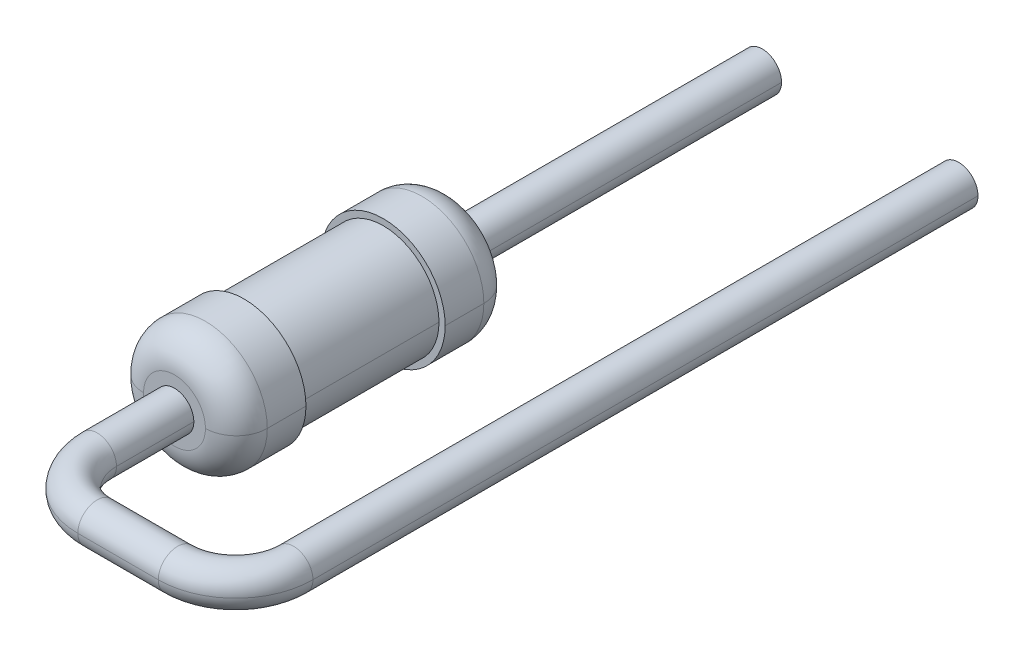
ISO-10303-21;
HEADER;
FILE_DESCRIPTION(('STEP AP214'),'2;1');
FILE_NAME('part.step','',(''),(''),'','','');
FILE_SCHEMA(('AUTOMOTIVE_DESIGN { 1 0 10303 214 1 1 1 1 }'));
ENDSEC;
DATA;
#1=APPLICATION_CONTEXT('core data for automotive mechanical design processes');
#2=APPLICATION_PROTOCOL_DEFINITION('international standard','automotive_design',2000,#1);
#3=PRODUCT_CONTEXT('',#1,'mechanical');
#4=PRODUCT('Part','Part','',(#3));
#5=PRODUCT_RELATED_PRODUCT_CATEGORY('part','',(#4));
#6=PRODUCT_DEFINITION_FORMATION('','',#4);
#7=PRODUCT_DEFINITION_CONTEXT('part definition',#1,'design');
#8=PRODUCT_DEFINITION('design','',#6,#7);
#9=PRODUCT_DEFINITION_SHAPE('','',#8);
#10=(LENGTH_UNIT() NAMED_UNIT(*) SI_UNIT(.MILLI.,.METRE.));
#11=(NAMED_UNIT(*) PLANE_ANGLE_UNIT() SI_UNIT($,.RADIAN.));
#12=(NAMED_UNIT(*) SI_UNIT($,.STERADIAN.) SOLID_ANGLE_UNIT());
#13=UNCERTAINTY_MEASURE_WITH_UNIT(LENGTH_MEASURE(1.E-05),#10,'distance_accuracy_value','');
#14=(GEOMETRIC_REPRESENTATION_CONTEXT(3) GLOBAL_UNCERTAINTY_ASSIGNED_CONTEXT((#13)) GLOBAL_UNIT_ASSIGNED_CONTEXT((#10,
#11,#12)) REPRESENTATION_CONTEXT('',''));
#15=CARTESIAN_POINT('',(0.,0.,0.));
#16=DIRECTION('',(0.,0.,1.));
#17=DIRECTION('',(1.,0.,0.));
#18=AXIS2_PLACEMENT_3D('',#15,#16,#17);
#19=CARTESIAN_POINT('',(0.,0.,1.));
#20=DIRECTION('',(0.,0.,-1.));
#21=DIRECTION('',(1.,0.,0.));
#22=AXIS2_PLACEMENT_3D('',#19,#20,#21);
#23=CYLINDRICAL_SURFACE('',#22,0.8);
#24=DIRECTION('',(0.,0.,-1.));
#25=VECTOR('',#24,1.);
#26=CARTESIAN_POINT('',(-0.8,0.,1.));
#27=LINE('',#26,#25);
#28=CARTESIAN_POINT('',(-0.8,0.,1.9));
#29=VERTEX_POINT('',#28);
#30=CARTESIAN_POINT('',(-0.8,0.,1.4));
#31=VERTEX_POINT('',#30);
#32=EDGE_CURVE('E224',#29,#31,#27,.T.);
#33=ORIENTED_EDGE('',*,*,#32,.F.);
#34=CARTESIAN_POINT('',(0.,0.,1.9));
#35=DIRECTION('',(0.,0.,1.));
#36=DIRECTION('',(1.,0.,0.));
#37=AXIS2_PLACEMENT_3D('',#34,#35,#36);
#38=CIRCLE('',#37,0.8);
#39=CARTESIAN_POINT('',(0.8,0.,1.9));
#40=VERTEX_POINT('',#39);
#41=EDGE_CURVE('E26',#40,#29,#38,.T.);
#42=ORIENTED_EDGE('',*,*,#41,.F.);
#43=DIRECTION('',(0.,0.,-1.));
#44=VECTOR('',#43,1.);
#45=CARTESIAN_POINT('',(0.8,0.,1.));
#46=LINE('',#45,#44);
#47=CARTESIAN_POINT('',(0.8,0.,1.4));
#48=VERTEX_POINT('',#47);
#49=EDGE_CURVE('E248',#40,#48,#46,.T.);
#50=ORIENTED_EDGE('',*,*,#49,.T.);
#51=CARTESIAN_POINT('',(0.,0.,1.4));
#52=DIRECTION('',(0.,0.,1.));
#53=DIRECTION('',(1.,0.,0.));
#54=AXIS2_PLACEMENT_3D('',#51,#52,#53);
#55=CIRCLE('',#54,0.8);
#56=EDGE_CURVE('E11',#48,#31,#55,.T.);
#57=ORIENTED_EDGE('',*,*,#56,.T.);
#58=EDGE_LOOP('',(#33,#42,#50,#57));
#59=FACE_BOUND('',#58,.T.);
#60=ADVANCED_FACE('F16',(#59),#23,.T.);
#61=CARTESIAN_POINT('',(0.,0.,1.4));
#62=DIRECTION('',(0.,0.,-1.));
#63=DIRECTION('',(1.,0.,0.));
#64=AXIS2_PLACEMENT_3D('',#61,#62,#63);
#65=DEGENERATE_TOROIDAL_SURFACE('',#64,0.4,0.4,.T.);
#66=CARTESIAN_POINT('',(-0.4,0.,1.4));
#67=DIRECTION('',(0.,-1.,0.));
#68=DIRECTION('',(1.,0.,0.));
#69=AXIS2_PLACEMENT_3D('',#66,#67,#68);
#70=CIRCLE('',#69,0.4);
#71=CARTESIAN_POINT('',(-0.4,0.,1.));
#72=VERTEX_POINT('',#71);
#73=EDGE_CURVE('E297',#31,#72,#70,.T.);
#74=ORIENTED_EDGE('',*,*,#73,.F.);
#75=ORIENTED_EDGE('',*,*,#56,.F.);
#76=CARTESIAN_POINT('',(0.4,0.,1.4));
#77=DIRECTION('',(0.,1.,0.));
#78=DIRECTION('',(0.,0.,1.));
#79=AXIS2_PLACEMENT_3D('',#76,#77,#78);
#80=CIRCLE('',#79,0.4);
#81=CARTESIAN_POINT('',(0.4,0.,1.));
#82=VERTEX_POINT('',#81);
#83=EDGE_CURVE('E20',#48,#82,#80,.T.);
#84=ORIENTED_EDGE('',*,*,#83,.T.);
#85=CARTESIAN_POINT('',(0.,0.,1.));
#86=DIRECTION('',(0.,0.,1.));
#87=DIRECTION('',(1.,0.,0.));
#88=AXIS2_PLACEMENT_3D('',#85,#86,#87);
#89=CIRCLE('',#88,0.4);
#90=EDGE_CURVE('E143',#82,#72,#89,.T.);
#91=ORIENTED_EDGE('',*,*,#90,.T.);
#92=EDGE_LOOP('',(#74,#75,#84,#91));
#93=FACE_BOUND('',#92,.T.);
#94=ADVANCED_FACE('F387',(#93),#65,.T.);
#95=CARTESIAN_POINT('',(0.8,0.,1.9));
#96=DIRECTION('',(0.,0.,-1.));
#97=DIRECTION('',(0.,-1.,0.));
#98=AXIS2_PLACEMENT_3D('',#95,#96,#97);
#99=PLANE('',#98);
#100=CARTESIAN_POINT('',(0.,0.,1.9));
#101=DIRECTION('',(0.,0.,-1.));
#102=DIRECTION('',(1.,0.,0.));
#103=AXIS2_PLACEMENT_3D('',#100,#101,#102);
#104=CIRCLE('',#103,0.72);
#105=CARTESIAN_POINT('',(0.72,0.,1.9));
#106=VERTEX_POINT('',#105);
#107=CARTESIAN_POINT('',(-0.72,0.,1.9));
#108=VERTEX_POINT('',#107);
#109=EDGE_CURVE('E240',#106,#108,#104,.T.);
#110=ORIENTED_EDGE('',*,*,#109,.T.);
#111=CARTESIAN_POINT('',(0.,0.,1.9));
#112=DIRECTION('',(0.,0.,-1.));
#113=DIRECTION('',(1.,0.,0.));
#114=AXIS2_PLACEMENT_3D('',#111,#112,#113);
#115=CIRCLE('',#114,0.72);
#116=EDGE_CURVE('E365',#108,#106,#115,.T.);
#117=ORIENTED_EDGE('',*,*,#116,.T.);
#118=EDGE_LOOP('',(#110,#117));
#119=FACE_BOUND('',#118,.T.);
#120=ORIENTED_EDGE('',*,*,#41,.T.);
#121=CARTESIAN_POINT('',(0.,0.,1.9));
#122=DIRECTION('',(0.,0.,1.));
#123=DIRECTION('',(1.,0.,0.));
#124=AXIS2_PLACEMENT_3D('',#121,#122,#123);
#125=CIRCLE('',#124,0.8);
#126=EDGE_CURVE('E207',#29,#40,#125,.T.);
#127=ORIENTED_EDGE('',*,*,#126,.T.);
#128=EDGE_LOOP('',(#120,#127));
#129=FACE_BOUND('',#128,.T.);
#130=ADVANCED_FACE('F383',(#119,#129),#99,.F.);
#131=CARTESIAN_POINT('',(0.8,0.,1.));
#132=DIRECTION('',(0.,0.,-1.));
#133=DIRECTION('',(0.,-1.,0.));
#134=AXIS2_PLACEMENT_3D('',#131,#132,#133);
#135=PLANE('',#134);
#136=CARTESIAN_POINT('',(0.,0.,1.));
#137=DIRECTION('',(0.,0.,1.));
#138=DIRECTION('',(1.,0.,0.));
#139=AXIS2_PLACEMENT_3D('',#136,#137,#138);
#140=CIRCLE('',#139,0.25);
#141=CARTESIAN_POINT('',(0.25,0.,1.));
#142=VERTEX_POINT('',#141);
#143=CARTESIAN_POINT('',(-0.25,0.,1.));
#144=VERTEX_POINT('',#143);
#145=EDGE_CURVE('E249',#142,#144,#140,.T.);
#146=ORIENTED_EDGE('',*,*,#145,.T.);
#147=CARTESIAN_POINT('',(0.,0.,1.));
#148=DIRECTION('',(0.,0.,1.));
#149=DIRECTION('',(1.,0.,0.));
#150=AXIS2_PLACEMENT_3D('',#147,#148,#149);
#151=CIRCLE('',#150,0.25);
#152=EDGE_CURVE('E334',#144,#142,#151,.T.);
#153=ORIENTED_EDGE('',*,*,#152,.T.);
#154=EDGE_LOOP('',(#146,#153));
#155=FACE_BOUND('',#154,.T.);
#156=ORIENTED_EDGE('',*,*,#90,.F.);
#157=CARTESIAN_POINT('',(0.,0.,1.));
#158=DIRECTION('',(0.,0.,1.));
#159=DIRECTION('',(1.,0.,0.));
#160=AXIS2_PLACEMENT_3D('',#157,#158,#159);
#161=CIRCLE('',#160,0.4);
#162=EDGE_CURVE('E293',#72,#82,#161,.T.);
#163=ORIENTED_EDGE('',*,*,#162,.F.);
#164=EDGE_LOOP('',(#156,#163));
#165=FACE_BOUND('',#164,.T.);
#166=ADVANCED_FACE('F386',(#155,#165),#135,.T.);
#167=CARTESIAN_POINT('',(0.,0.,1.));
#168=DIRECTION('',(0.,0.,-1.));
#169=DIRECTION('',(1.,0.,0.));
#170=AXIS2_PLACEMENT_3D('',#167,#168,#169);
#171=CYLINDRICAL_SURFACE('',#170,0.72);
#172=DIRECTION('',(0.,0.,-1.));
#173=VECTOR('',#172,1.);
#174=CARTESIAN_POINT('',(-0.72,0.,1.));
#175=LINE('',#174,#173);
#176=CARTESIAN_POINT('',(-0.72,0.,3.7));
#177=VERTEX_POINT('',#176);
#178=EDGE_CURVE('E234',#177,#108,#175,.T.);
#179=ORIENTED_EDGE('',*,*,#178,.F.);
#180=CARTESIAN_POINT('',(0.,0.,3.7));
#181=DIRECTION('',(0.,0.,-1.));
#182=DIRECTION('',(1.,0.,0.));
#183=AXIS2_PLACEMENT_3D('',#180,#181,#182);
#184=CIRCLE('',#183,0.72);
#185=CARTESIAN_POINT('',(0.72,0.,3.7));
#186=VERTEX_POINT('',#185);
#187=EDGE_CURVE('E325',#177,#186,#184,.T.);
#188=ORIENTED_EDGE('',*,*,#187,.T.);
#189=DIRECTION('',(0.,0.,-1.));
#190=VECTOR('',#189,1.);
#191=CARTESIAN_POINT('',(0.72,0.,1.));
#192=LINE('',#191,#190);
#193=EDGE_CURVE('E244',#186,#106,#192,.T.);
#194=ORIENTED_EDGE('',*,*,#193,.T.);
#195=ORIENTED_EDGE('',*,*,#116,.F.);
#196=EDGE_LOOP('',(#179,#188,#194,#195));
#197=FACE_BOUND('',#196,.T.);
#198=ADVANCED_FACE('F378',(#197),#171,.T.);
#199=CARTESIAN_POINT('',(0.,0.,-3.));
#200=DIRECTION('',(0.,0.,1.));
#201=DIRECTION('',(1.,0.,0.));
#202=AXIS2_PLACEMENT_3D('',#199,#200,#201);
#203=CYLINDRICAL_SURFACE('',#202,0.25);
#204=DIRECTION('',(0.,0.,1.));
#205=VECTOR('',#204,1.);
#206=CARTESIAN_POINT('',(-0.25,0.,-3.));
#207=LINE('',#206,#205);
#208=CARTESIAN_POINT('',(-0.25,0.,-3.));
#209=VERTEX_POINT('',#208);
#210=EDGE_CURVE('E254',#209,#144,#207,.T.);
#211=ORIENTED_EDGE('',*,*,#210,.F.);
#212=CARTESIAN_POINT('',(0.,0.,-3.));
#213=DIRECTION('',(0.,0.,1.));
#214=DIRECTION('',(1.,0.,0.));
#215=AXIS2_PLACEMENT_3D('',#212,#213,#214);
#216=CIRCLE('',#215,0.25);
#217=CARTESIAN_POINT('',(0.25,0.,-3.));
#218=VERTEX_POINT('',#217);
#219=EDGE_CURVE('E320',#209,#218,#216,.T.);
#220=ORIENTED_EDGE('',*,*,#219,.T.);
#221=DIRECTION('',(0.,0.,1.));
#222=VECTOR('',#221,1.);
#223=CARTESIAN_POINT('',(0.25,0.,-3.));
#224=LINE('',#223,#222);
#225=EDGE_CURVE('E253',#218,#142,#224,.T.);
#226=ORIENTED_EDGE('',*,*,#225,.T.);
#227=ORIENTED_EDGE('',*,*,#152,.F.);
#228=EDGE_LOOP('',(#211,#220,#226,#227));
#229=FACE_BOUND('',#228,.T.);
#230=ADVANCED_FACE('F616',(#229),#203,.T.);
#231=CARTESIAN_POINT('',(0.8,0.,3.7));
#232=DIRECTION('',(0.,0.,-1.));
#233=DIRECTION('',(0.,-1.,0.));
#234=AXIS2_PLACEMENT_3D('',#231,#232,#233);
#235=PLANE('',#234);
#236=CARTESIAN_POINT('',(0.,0.,3.7));
#237=DIRECTION('',(0.,0.,-1.));
#238=DIRECTION('',(1.,0.,0.));
#239=AXIS2_PLACEMENT_3D('',#236,#237,#238);
#240=CIRCLE('',#239,0.72);
#241=EDGE_CURVE('E230',#186,#177,#240,.T.);
#242=ORIENTED_EDGE('',*,*,#241,.F.);
#243=ORIENTED_EDGE('',*,*,#187,.F.);
#244=EDGE_LOOP('',(#242,#243));
#245=FACE_BOUND('',#244,.T.);
#246=CARTESIAN_POINT('',(0.,0.,3.7));
#247=DIRECTION('',(0.,0.,1.));
#248=DIRECTION('',(1.,0.,0.));
#249=AXIS2_PLACEMENT_3D('',#246,#247,#248);
#250=CIRCLE('',#249,0.8);
#251=CARTESIAN_POINT('',(0.8,0.,3.7));
#252=VERTEX_POINT('',#251);
#253=CARTESIAN_POINT('',(-0.8,0.,3.7));
#254=VERTEX_POINT('',#253);
#255=EDGE_CURVE('E311',#252,#254,#250,.T.);
#256=ORIENTED_EDGE('',*,*,#255,.F.);
#257=CARTESIAN_POINT('',(0.,0.,3.7));
#258=DIRECTION('',(0.,0.,1.));
#259=DIRECTION('',(1.,0.,0.));
#260=AXIS2_PLACEMENT_3D('',#257,#258,#259);
#261=CIRCLE('',#260,0.8);
#262=EDGE_CURVE('E346',#254,#252,#261,.T.);
#263=ORIENTED_EDGE('',*,*,#262,.F.);
#264=EDGE_LOOP('',(#256,#263));
#265=FACE_BOUND('',#264,.T.);
#266=ADVANCED_FACE('F575',(#245,#265),#235,.T.);
#267=CARTESIAN_POINT('',(0.25,0.,-3.));
#268=DIRECTION('',(0.,0.,-1.));
#269=DIRECTION('',(0.,-1.,0.));
#270=AXIS2_PLACEMENT_3D('',#267,#268,#269);
#271=PLANE('',#270);
#272=CARTESIAN_POINT('',(0.,0.,-3.));
#273=DIRECTION('',(0.,0.,1.));
#274=DIRECTION('',(1.,0.,0.));
#275=AXIS2_PLACEMENT_3D('',#272,#273,#274);
#276=CIRCLE('',#275,0.25);
#277=EDGE_CURVE('E279',#218,#209,#276,.T.);
#278=ORIENTED_EDGE('',*,*,#277,.F.);
#279=ORIENTED_EDGE('',*,*,#219,.F.);
#280=EDGE_LOOP('',(#278,#279));
#281=FACE_BOUND('',#280,.T.);
#282=ADVANCED_FACE('F535',(#281),#271,.T.);
#283=CARTESIAN_POINT('',(0.,0.,3.7));
#284=DIRECTION('',(0.,0.,-1.));
#285=DIRECTION('',(1.,0.,0.));
#286=AXIS2_PLACEMENT_3D('',#283,#284,#285);
#287=CYLINDRICAL_SURFACE('',#286,0.8);
#288=DIRECTION('',(0.,0.,-1.));
#289=VECTOR('',#288,1.);
#290=CARTESIAN_POINT('',(-0.8,0.,3.7));
#291=LINE('',#290,#289);
#292=CARTESIAN_POINT('',(-0.8,0.,4.2));
#293=VERTEX_POINT('',#292);
#294=EDGE_CURVE('E342',#293,#254,#291,.T.);
#295=ORIENTED_EDGE('',*,*,#294,.F.);
#296=CARTESIAN_POINT('',(0.,0.,4.2));
#297=DIRECTION('',(0.,0.,1.));
#298=DIRECTION('',(1.,0.,0.));
#299=AXIS2_PLACEMENT_3D('',#296,#297,#298);
#300=CIRCLE('',#299,0.8);
#301=CARTESIAN_POINT('',(0.8,0.,4.2));
#302=VERTEX_POINT('',#301);
#303=EDGE_CURVE('E275',#302,#293,#300,.T.);
#304=ORIENTED_EDGE('',*,*,#303,.F.);
#305=DIRECTION('',(0.,0.,-1.));
#306=VECTOR('',#305,1.);
#307=CARTESIAN_POINT('',(0.8,0.,3.7));
#308=LINE('',#307,#306);
#309=EDGE_CURVE('E222',#302,#252,#308,.T.);
#310=ORIENTED_EDGE('',*,*,#309,.T.);
#311=ORIENTED_EDGE('',*,*,#255,.T.);
#312=EDGE_LOOP('',(#295,#304,#310,#311));
#313=FACE_BOUND('',#312,.T.);
#314=ADVANCED_FACE('F434',(#313),#287,.T.);
#315=CARTESIAN_POINT('',(0.,0.,4.2));
#316=DIRECTION('',(0.,0.,1.));
#317=DIRECTION('',(1.,0.,0.));
#318=AXIS2_PLACEMENT_3D('',#315,#316,#317);
#319=DEGENERATE_TOROIDAL_SURFACE('',#318,0.4,0.4,.T.);
#320=CARTESIAN_POINT('',(-0.4,0.,4.2));
#321=DIRECTION('',(0.,1.,0.));
#322=DIRECTION('',(-1.,0.,0.));
#323=AXIS2_PLACEMENT_3D('',#320,#321,#322);
#324=CIRCLE('',#323,0.4);
#325=CARTESIAN_POINT('',(-0.4,0.,4.6));
#326=VERTEX_POINT('',#325);
#327=EDGE_CURVE('E270',#293,#326,#324,.T.);
#328=ORIENTED_EDGE('',*,*,#327,.F.);
#329=CARTESIAN_POINT('',(0.,0.,4.2));
#330=DIRECTION('',(0.,0.,1.));
#331=DIRECTION('',(1.,0.,0.));
#332=AXIS2_PLACEMENT_3D('',#329,#330,#331);
#333=CIRCLE('',#332,0.8);
#334=EDGE_CURVE('E269',#293,#302,#333,.T.);
#335=ORIENTED_EDGE('',*,*,#334,.T.);
#336=CARTESIAN_POINT('',(0.4,0.,4.2));
#337=DIRECTION('',(0.,-1.,0.));
#338=DIRECTION('',(0.,0.,-1.));
#339=AXIS2_PLACEMENT_3D('',#336,#337,#338);
#340=CIRCLE('',#339,0.4);
#341=CARTESIAN_POINT('',(0.4,0.,4.6));
#342=VERTEX_POINT('',#341);
#343=EDGE_CURVE('E260',#302,#342,#340,.T.);
#344=ORIENTED_EDGE('',*,*,#343,.T.);
#345=CARTESIAN_POINT('',(0.,0.,4.6));
#346=DIRECTION('',(0.,0.,1.));
#347=DIRECTION('',(1.,0.,0.));
#348=AXIS2_PLACEMENT_3D('',#345,#346,#347);
#349=CIRCLE('',#348,0.4);
#350=EDGE_CURVE('E303',#326,#342,#349,.T.);
#351=ORIENTED_EDGE('',*,*,#350,.F.);
#352=EDGE_LOOP('',(#328,#335,#344,#351));
#353=FACE_BOUND('',#352,.T.);
#354=ADVANCED_FACE('F429',(#353),#319,.T.);
#355=CARTESIAN_POINT('',(0.8,0.,4.6));
#356=DIRECTION('',(0.,0.,-1.));
#357=DIRECTION('',(0.,-1.,0.));
#358=AXIS2_PLACEMENT_3D('',#355,#356,#357);
#359=PLANE('',#358);
#360=CARTESIAN_POINT('',(0.,0.,4.6));
#361=DIRECTION('',(0.,0.,1.));
#362=DIRECTION('',(1.,0.,0.));
#363=AXIS2_PLACEMENT_3D('',#360,#361,#362);
#364=CIRCLE('',#363,0.25);
#365=CARTESIAN_POINT('',(0.25,0.,4.6));
#366=VERTEX_POINT('',#365);
#367=CARTESIAN_POINT('',(-0.25,0.,4.6));
#368=VERTEX_POINT('',#367);
#369=EDGE_CURVE('E255',#366,#368,#364,.T.);
#370=ORIENTED_EDGE('',*,*,#369,.F.);
#371=CARTESIAN_POINT('',(0.,0.,4.6));
#372=DIRECTION('',(0.,0.,1.));
#373=DIRECTION('',(1.,0.,0.));
#374=AXIS2_PLACEMENT_3D('',#371,#372,#373);
#375=CIRCLE('',#374,0.25);
#376=EDGE_CURVE('E300',#368,#366,#375,.T.);
#377=ORIENTED_EDGE('',*,*,#376,.F.);
#378=EDGE_LOOP('',(#370,#377));
#379=FACE_BOUND('',#378,.T.);
#380=CARTESIAN_POINT('',(0.,0.,4.6));
#381=DIRECTION('',(0.,0.,1.));
#382=DIRECTION('',(1.,0.,0.));
#383=AXIS2_PLACEMENT_3D('',#380,#381,#382);
#384=CIRCLE('',#383,0.4);
#385=EDGE_CURVE('E274',#342,#326,#384,.T.);
#386=ORIENTED_EDGE('',*,*,#385,.T.);
#387=ORIENTED_EDGE('',*,*,#350,.T.);
#388=EDGE_LOOP('',(#386,#387));
#389=FACE_BOUND('',#388,.T.);
#390=ADVANCED_FACE('F433',(#379,#389),#359,.F.);
#391=CARTESIAN_POINT('',(0.,0.,-3.));
#392=DIRECTION('',(0.,0.,1.));
#393=DIRECTION('',(1.,0.,0.));
#394=AXIS2_PLACEMENT_3D('',#391,#392,#393);
#395=CYLINDRICAL_SURFACE('',#394,0.25);
#396=DIRECTION('',(0.,0.,1.));
#397=VECTOR('',#396,1.);
#398=CARTESIAN_POINT('',(-0.25,0.,-3.));
#399=LINE('',#398,#397);
#400=CARTESIAN_POINT('',(-0.25,0.,5.6));
#401=VERTEX_POINT('',#400);
#402=EDGE_CURVE('E259',#368,#401,#399,.T.);
#403=ORIENTED_EDGE('',*,*,#402,.F.);
#404=ORIENTED_EDGE('',*,*,#376,.T.);
#405=DIRECTION('',(0.,0.,1.));
#406=VECTOR('',#405,1.);
#407=CARTESIAN_POINT('',(0.25,0.,-3.));
#408=LINE('',#407,#406);
#409=CARTESIAN_POINT('',(0.25,0.,5.6));
#410=VERTEX_POINT('',#409);
#411=EDGE_CURVE('E261',#366,#410,#408,.T.);
#412=ORIENTED_EDGE('',*,*,#411,.T.);
#413=CARTESIAN_POINT('',(0.,0.,5.6));
#414=DIRECTION('',(0.,0.,1.));
#415=DIRECTION('',(1.,0.,0.));
#416=AXIS2_PLACEMENT_3D('',#413,#414,#415);
#417=CIRCLE('',#416,0.25);
#418=EDGE_CURVE('E298',#401,#410,#417,.T.);
#419=ORIENTED_EDGE('',*,*,#418,.F.);
#420=EDGE_LOOP('',(#403,#404,#412,#419));
#421=FACE_BOUND('',#420,.T.);
#422=ADVANCED_FACE('F413',(#421),#395,.T.);
#423=CARTESIAN_POINT('',(0.75,0.,5.6));
#424=DIRECTION('',(0.,1.,0.));
#425=DIRECTION('',(-1.,0.,0.));
#426=AXIS2_PLACEMENT_3D('',#423,#424,#425);
#427=TOROIDAL_SURFACE('',#426,0.75,0.25);
#428=CARTESIAN_POINT('',(0.75,0.,5.6));
#429=DIRECTION('',(0.,1.,0.));
#430=DIRECTION('',(0.,0.,1.));
#431=AXIS2_PLACEMENT_3D('',#428,#429,#430);
#432=CIRCLE('',#431,1.);
#433=CARTESIAN_POINT('',(0.75,0.,6.6));
#434=VERTEX_POINT('',#433);
#435=EDGE_CURVE('E283',#401,#434,#432,.T.);
#436=ORIENTED_EDGE('',*,*,#435,.F.);
#437=ORIENTED_EDGE('',*,*,#418,.T.);
#438=CARTESIAN_POINT('',(0.75,0.,5.6));
#439=DIRECTION('',(0.,1.,0.));
#440=DIRECTION('',(0.,0.,1.));
#441=AXIS2_PLACEMENT_3D('',#438,#439,#440);
#442=CIRCLE('',#441,0.5);
#443=CARTESIAN_POINT('',(0.75,0.,6.1));
#444=VERTEX_POINT('',#443);
#445=EDGE_CURVE('E341',#410,#444,#442,.T.);
#446=ORIENTED_EDGE('',*,*,#445,.T.);
#447=CARTESIAN_POINT('',(0.75,0.,6.35));
#448=DIRECTION('',(-1.,0.,0.));
#449=DIRECTION('',(0.,0.,1.));
#450=AXIS2_PLACEMENT_3D('',#447,#448,#449);
#451=CIRCLE('',#450,0.25);
#452=EDGE_CURVE('E301',#444,#434,#451,.T.);
#453=ORIENTED_EDGE('',*,*,#452,.T.);
#454=EDGE_LOOP('',(#436,#437,#446,#453));
#455=FACE_BOUND('',#454,.T.);
#456=ADVANCED_FACE('F407',(#455),#427,.T.);
#457=CARTESIAN_POINT('',(0.75,0.,6.35));
#458=DIRECTION('',(1.,0.,0.));
#459=DIRECTION('',(0.,0.,-1.));
#460=AXIS2_PLACEMENT_3D('',#457,#458,#459);
#461=CYLINDRICAL_SURFACE('',#460,0.25);
#462=DIRECTION('',(1.,0.,0.));
#463=VECTOR('',#462,1.);
#464=CARTESIAN_POINT('',(0.75,0.,6.6));
#465=LINE('',#464,#463);
#466=CARTESIAN_POINT('',(1.79,0.,6.6));
#467=VERTEX_POINT('',#466);
#468=EDGE_CURVE('E265',#434,#467,#465,.T.);
#469=ORIENTED_EDGE('',*,*,#468,.F.);
#470=ORIENTED_EDGE('',*,*,#452,.F.);
#471=DIRECTION('',(1.,0.,0.));
#472=VECTOR('',#471,1.);
#473=CARTESIAN_POINT('',(0.75,0.,6.1));
#474=LINE('',#473,#472);
#475=CARTESIAN_POINT('',(1.79,0.,6.1));
#476=VERTEX_POINT('',#475);
#477=EDGE_CURVE('E292',#444,#476,#474,.T.);
#478=ORIENTED_EDGE('',*,*,#477,.T.);
#479=CARTESIAN_POINT('',(1.79,0.,6.35));
#480=DIRECTION('',(1.,0.,0.));
#481=DIRECTION('',(0.,0.,-1.));
#482=AXIS2_PLACEMENT_3D('',#479,#480,#481);
#483=CIRCLE('',#482,0.25);
#484=EDGE_CURVE('E189',#467,#476,#483,.T.);
#485=ORIENTED_EDGE('',*,*,#484,.F.);
#486=EDGE_LOOP('',(#469,#470,#478,#485));
#487=FACE_BOUND('',#486,.T.);
#488=ADVANCED_FACE('F412',(#487),#461,.T.);
#489=CARTESIAN_POINT('',(1.79,0.,5.6));
#490=DIRECTION('',(0.,1.,0.));
#491=DIRECTION('',(0.,0.,1.));
#492=AXIS2_PLACEMENT_3D('',#489,#490,#491);
#493=TOROIDAL_SURFACE('',#492,0.75,0.25);
#494=CARTESIAN_POINT('',(1.79,0.,5.6));
#495=DIRECTION('',(0.,1.,0.));
#496=DIRECTION('',(0.,0.,1.));
#497=AXIS2_PLACEMENT_3D('',#494,#495,#496);
#498=CIRCLE('',#497,1.);
#499=CARTESIAN_POINT('',(2.79,0.,5.6));
#500=VERTEX_POINT('',#499);
#501=EDGE_CURVE('E210',#467,#500,#498,.T.);
#502=ORIENTED_EDGE('',*,*,#501,.F.);
#503=ORIENTED_EDGE('',*,*,#484,.T.);
#504=CARTESIAN_POINT('',(1.79,0.,5.6));
#505=DIRECTION('',(0.,1.,0.));
#506=DIRECTION('',(0.,0.,1.));
#507=AXIS2_PLACEMENT_3D('',#504,#505,#506);
#508=CIRCLE('',#507,0.5);
#509=CARTESIAN_POINT('',(2.29,0.,5.6));
#510=VERTEX_POINT('',#509);
#511=EDGE_CURVE('E200',#476,#510,#508,.T.);
#512=ORIENTED_EDGE('',*,*,#511,.T.);
#513=CARTESIAN_POINT('',(2.54,0.,5.6));
#514=DIRECTION('',(0.,0.,1.));
#515=DIRECTION('',(1.,0.,0.));
#516=AXIS2_PLACEMENT_3D('',#513,#514,#515);
#517=CIRCLE('',#516,0.25);
#518=EDGE_CURVE('E177',#510,#500,#517,.T.);
#519=ORIENTED_EDGE('',*,*,#518,.T.);
#520=EDGE_LOOP('',(#502,#503,#512,#519));
#521=FACE_BOUND('',#520,.T.);
#522=ADVANCED_FACE('F201',(#521),#493,.T.);
#523=CARTESIAN_POINT('',(2.54,0.,5.6));
#524=DIRECTION('',(0.,0.,-1.));
#525=DIRECTION('',(-1.,0.,0.));
#526=AXIS2_PLACEMENT_3D('',#523,#524,#525);
#527=CYLINDRICAL_SURFACE('',#526,0.25);
#528=DIRECTION('',(0.,0.,-1.));
#529=VECTOR('',#528,1.);
#530=CARTESIAN_POINT('',(2.79,0.,5.6));
#531=LINE('',#530,#529);
#532=CARTESIAN_POINT('',(2.79,0.,-3.));
#533=VERTEX_POINT('',#532);
#534=EDGE_CURVE('E183',#500,#533,#531,.T.);
#535=ORIENTED_EDGE('',*,*,#534,.F.);
#536=ORIENTED_EDGE('',*,*,#518,.F.);
#537=DIRECTION('',(0.,0.,-1.));
#538=VECTOR('',#537,1.);
#539=CARTESIAN_POINT('',(2.29,0.,5.6));
#540=LINE('',#539,#538);
#541=CARTESIAN_POINT('',(2.29,0.,-3.));
#542=VERTEX_POINT('',#541);
#543=EDGE_CURVE('E180',#510,#542,#540,.T.);
#544=ORIENTED_EDGE('',*,*,#543,.T.);
#545=CARTESIAN_POINT('',(2.54,0.,-3.));
#546=DIRECTION('',(0.,0.,-1.));
#547=DIRECTION('',(-1.,0.,0.));
#548=AXIS2_PLACEMENT_3D('',#545,#546,#547);
#549=CIRCLE('',#548,0.25);
#550=EDGE_CURVE('E39',#533,#542,#549,.T.);
#551=ORIENTED_EDGE('',*,*,#550,.F.);
#552=EDGE_LOOP('',(#535,#536,#544,#551));
#553=FACE_BOUND('',#552,.T.);
#554=ADVANCED_FACE('F179',(#553),#527,.T.);
#555=CARTESIAN_POINT('',(2.29,0.,-3.));
#556=DIRECTION('',(0.,0.,1.));
#557=DIRECTION('',(1.,0.,0.));
#558=AXIS2_PLACEMENT_3D('',#555,#556,#557);
#559=PLANE('',#558);
#560=CARTESIAN_POINT('',(2.54,0.,-3.));
#561=DIRECTION('',(0.,0.,-1.));
#562=DIRECTION('',(-1.,0.,0.));
#563=AXIS2_PLACEMENT_3D('',#560,#561,#562);
#564=CIRCLE('',#563,0.25);
#565=EDGE_CURVE('E196',#542,#533,#564,.T.);
#566=ORIENTED_EDGE('',*,*,#565,.T.);
#567=ORIENTED_EDGE('',*,*,#550,.T.);
#568=EDGE_LOOP('',(#566,#567));
#569=FACE_BOUND('',#568,.T.);
#570=ADVANCED_FACE('F488',(#569),#559,.F.);
#571=CARTESIAN_POINT('',(2.54,0.,5.6));
#572=DIRECTION('',(0.,0.,-1.));
#573=DIRECTION('',(-1.,0.,0.));
#574=AXIS2_PLACEMENT_3D('',#571,#572,#573);
#575=CYLINDRICAL_SURFACE('',#574,0.25);
#576=CARTESIAN_POINT('',(2.54,0.,5.6));
#577=DIRECTION('',(0.,0.,1.));
#578=DIRECTION('',(1.,0.,0.));
#579=AXIS2_PLACEMENT_3D('',#576,#577,#578);
#580=CIRCLE('',#579,0.25);
#581=EDGE_CURVE('E194',#500,#510,#580,.T.);
#582=ORIENTED_EDGE('',*,*,#581,.F.);
#583=ORIENTED_EDGE('',*,*,#534,.T.);
#584=ORIENTED_EDGE('',*,*,#565,.F.);
#585=ORIENTED_EDGE('',*,*,#543,.F.);
#586=EDGE_LOOP('',(#582,#583,#584,#585));
#587=FACE_BOUND('',#586,.T.);
#588=ADVANCED_FACE('F192',(#587),#575,.T.);
#589=CARTESIAN_POINT('',(0.75,0.,6.35));
#590=DIRECTION('',(1.,0.,0.));
#591=DIRECTION('',(0.,0.,-1.));
#592=AXIS2_PLACEMENT_3D('',#589,#590,#591);
#593=CYLINDRICAL_SURFACE('',#592,0.25);
#594=CARTESIAN_POINT('',(0.75,0.,6.35));
#595=DIRECTION('',(-1.,0.,0.));
#596=DIRECTION('',(0.,0.,1.));
#597=AXIS2_PLACEMENT_3D('',#594,#595,#596);
#598=CIRCLE('',#597,0.25);
#599=EDGE_CURVE('E287',#434,#444,#598,.T.);
#600=ORIENTED_EDGE('',*,*,#599,.F.);
#601=ORIENTED_EDGE('',*,*,#468,.T.);
#602=CARTESIAN_POINT('',(1.79,0.,6.35));
#603=DIRECTION('',(1.,0.,0.));
#604=DIRECTION('',(0.,0.,-1.));
#605=AXIS2_PLACEMENT_3D('',#602,#603,#604);
#606=CIRCLE('',#605,0.25);
#607=EDGE_CURVE('E218',#476,#467,#606,.T.);
#608=ORIENTED_EDGE('',*,*,#607,.F.);
#609=ORIENTED_EDGE('',*,*,#477,.F.);
#610=EDGE_LOOP('',(#600,#601,#608,#609));
#611=FACE_BOUND('',#610,.T.);
#612=ADVANCED_FACE('F467',(#611),#593,.T.);
#613=CARTESIAN_POINT('',(0.,0.,-3.));
#614=DIRECTION('',(0.,0.,1.));
#615=DIRECTION('',(1.,0.,0.));
#616=AXIS2_PLACEMENT_3D('',#613,#614,#615);
#617=CYLINDRICAL_SURFACE('',#616,0.25);
#618=ORIENTED_EDGE('',*,*,#369,.T.);
#619=ORIENTED_EDGE('',*,*,#402,.T.);
#620=CARTESIAN_POINT('',(0.,0.,5.6));
#621=DIRECTION('',(0.,0.,1.));
#622=DIRECTION('',(1.,0.,0.));
#623=AXIS2_PLACEMENT_3D('',#620,#621,#622);
#624=CIRCLE('',#623,0.25);
#625=EDGE_CURVE('E288',#410,#401,#624,.T.);
#626=ORIENTED_EDGE('',*,*,#625,.F.);
#627=ORIENTED_EDGE('',*,*,#411,.F.);
#628=EDGE_LOOP('',(#618,#619,#626,#627));
#629=FACE_BOUND('',#628,.T.);
#630=ADVANCED_FACE('F462',(#629),#617,.T.);
#631=CARTESIAN_POINT('',(0.,0.,4.2));
#632=DIRECTION('',(0.,0.,1.));
#633=DIRECTION('',(1.,0.,0.));
#634=AXIS2_PLACEMENT_3D('',#631,#632,#633);
#635=DEGENERATE_TOROIDAL_SURFACE('',#634,0.4,0.4,.T.);
#636=ORIENTED_EDGE('',*,*,#303,.T.);
#637=ORIENTED_EDGE('',*,*,#327,.T.);
#638=ORIENTED_EDGE('',*,*,#385,.F.);
#639=ORIENTED_EDGE('',*,*,#343,.F.);
#640=EDGE_LOOP('',(#636,#637,#638,#639));
#641=FACE_BOUND('',#640,.T.);
#642=ADVANCED_FACE('F466',(#641),#635,.T.);
#643=CARTESIAN_POINT('',(0.,0.,3.7));
#644=DIRECTION('',(0.,0.,-1.));
#645=DIRECTION('',(1.,0.,0.));
#646=AXIS2_PLACEMENT_3D('',#643,#644,#645);
#647=CYLINDRICAL_SURFACE('',#646,0.8);
#648=ORIENTED_EDGE('',*,*,#334,.F.);
#649=ORIENTED_EDGE('',*,*,#294,.T.);
#650=ORIENTED_EDGE('',*,*,#262,.T.);
#651=ORIENTED_EDGE('',*,*,#309,.F.);
#652=EDGE_LOOP('',(#648,#649,#650,#651));
#653=FACE_BOUND('',#652,.T.);
#654=ADVANCED_FACE('F18',(#653),#647,.T.);
#655=CARTESIAN_POINT('',(0.,0.,-3.));
#656=DIRECTION('',(0.,0.,1.));
#657=DIRECTION('',(1.,0.,0.));
#658=AXIS2_PLACEMENT_3D('',#655,#656,#657);
#659=CYLINDRICAL_SURFACE('',#658,0.25);
#660=ORIENTED_EDGE('',*,*,#277,.T.);
#661=ORIENTED_EDGE('',*,*,#210,.T.);
#662=ORIENTED_EDGE('',*,*,#145,.F.);
#663=ORIENTED_EDGE('',*,*,#225,.F.);
#664=EDGE_LOOP('',(#660,#661,#662,#663));
#665=FACE_BOUND('',#664,.T.);
#666=ADVANCED_FACE('F451',(#665),#659,.T.);
#667=CARTESIAN_POINT('',(0.,0.,1.));
#668=DIRECTION('',(0.,0.,-1.));
#669=DIRECTION('',(1.,0.,0.));
#670=AXIS2_PLACEMENT_3D('',#667,#668,#669);
#671=CYLINDRICAL_SURFACE('',#670,0.72);
#672=ORIENTED_EDGE('',*,*,#241,.T.);
#673=ORIENTED_EDGE('',*,*,#178,.T.);
#674=ORIENTED_EDGE('',*,*,#109,.F.);
#675=ORIENTED_EDGE('',*,*,#193,.F.);
#676=EDGE_LOOP('',(#672,#673,#674,#675));
#677=FACE_BOUND('',#676,.T.);
#678=ADVANCED_FACE('F381',(#677),#671,.T.);
#679=CARTESIAN_POINT('',(0.,0.,1.4));
#680=DIRECTION('',(0.,0.,-1.));
#681=DIRECTION('',(1.,0.,0.));
#682=AXIS2_PLACEMENT_3D('',#679,#680,#681);
#683=DEGENERATE_TOROIDAL_SURFACE('',#682,0.4,0.4,.T.);
#684=CARTESIAN_POINT('',(0.,0.,1.4));
#685=DIRECTION('',(0.,0.,1.));
#686=DIRECTION('',(1.,0.,0.));
#687=AXIS2_PLACEMENT_3D('',#684,#685,#686);
#688=CIRCLE('',#687,0.8);
#689=EDGE_CURVE('E227',#31,#48,#688,.T.);
#690=ORIENTED_EDGE('',*,*,#689,.F.);
#691=ORIENTED_EDGE('',*,*,#73,.T.);
#692=ORIENTED_EDGE('',*,*,#162,.T.);
#693=ORIENTED_EDGE('',*,*,#83,.F.);
#694=EDGE_LOOP('',(#690,#691,#692,#693));
#695=FACE_BOUND('',#694,.T.);
#696=ADVANCED_FACE('F398',(#695),#683,.T.);
#697=CARTESIAN_POINT('',(0.,0.,1.));
#698=DIRECTION('',(0.,0.,-1.));
#699=DIRECTION('',(1.,0.,0.));
#700=AXIS2_PLACEMENT_3D('',#697,#698,#699);
#701=CYLINDRICAL_SURFACE('',#700,0.8);
#702=ORIENTED_EDGE('',*,*,#126,.F.);
#703=ORIENTED_EDGE('',*,*,#32,.T.);
#704=ORIENTED_EDGE('',*,*,#689,.T.);
#705=ORIENTED_EDGE('',*,*,#49,.F.);
#706=EDGE_LOOP('',(#702,#703,#704,#705));
#707=FACE_BOUND('',#706,.T.);
#708=ADVANCED_FACE('F394',(#707),#701,.T.);
#709=CARTESIAN_POINT('',(1.79,0.,5.6));
#710=DIRECTION('',(0.,1.,0.));
#711=DIRECTION('',(0.,0.,1.));
#712=AXIS2_PLACEMENT_3D('',#709,#710,#711);
#713=TOROIDAL_SURFACE('',#712,0.75,0.25);
#714=ORIENTED_EDGE('',*,*,#607,.T.);
#715=ORIENTED_EDGE('',*,*,#501,.T.);
#716=ORIENTED_EDGE('',*,*,#581,.T.);
#717=ORIENTED_EDGE('',*,*,#511,.F.);
#718=EDGE_LOOP('',(#714,#715,#716,#717));
#719=FACE_BOUND('',#718,.T.);
#720=ADVANCED_FACE('F209',(#719),#713,.T.);
#721=CARTESIAN_POINT('',(0.75,0.,5.6));
#722=DIRECTION('',(0.,1.,0.));
#723=DIRECTION('',(-1.,0.,0.));
#724=AXIS2_PLACEMENT_3D('',#721,#722,#723);
#725=TOROIDAL_SURFACE('',#724,0.75,0.25);
#726=ORIENTED_EDGE('',*,*,#625,.T.);
#727=ORIENTED_EDGE('',*,*,#435,.T.);
#728=ORIENTED_EDGE('',*,*,#599,.T.);
#729=ORIENTED_EDGE('',*,*,#445,.F.);
#730=EDGE_LOOP('',(#726,#727,#728,#729));
#731=FACE_BOUND('',#730,.T.);
#732=ADVANCED_FACE('F546',(#731),#725,.T.);
#733=CLOSED_SHELL('',(#60,#94,#130,#166,#198,#230,#266,#282,#314,#354,#390,#422,#456,#488,#522,
#554,#570,#588,#612,#630,#642,#654,#666,#678,#696,#708,#720,#732));
#734=MANIFOLD_SOLID_BREP('B1',#733);
#735=ADVANCED_BREP_SHAPE_REPRESENTATION('',(#18,#734),#14);
#736=SHAPE_DEFINITION_REPRESENTATION(#9,#735);
ENDSEC;
END-ISO-10303-21;
